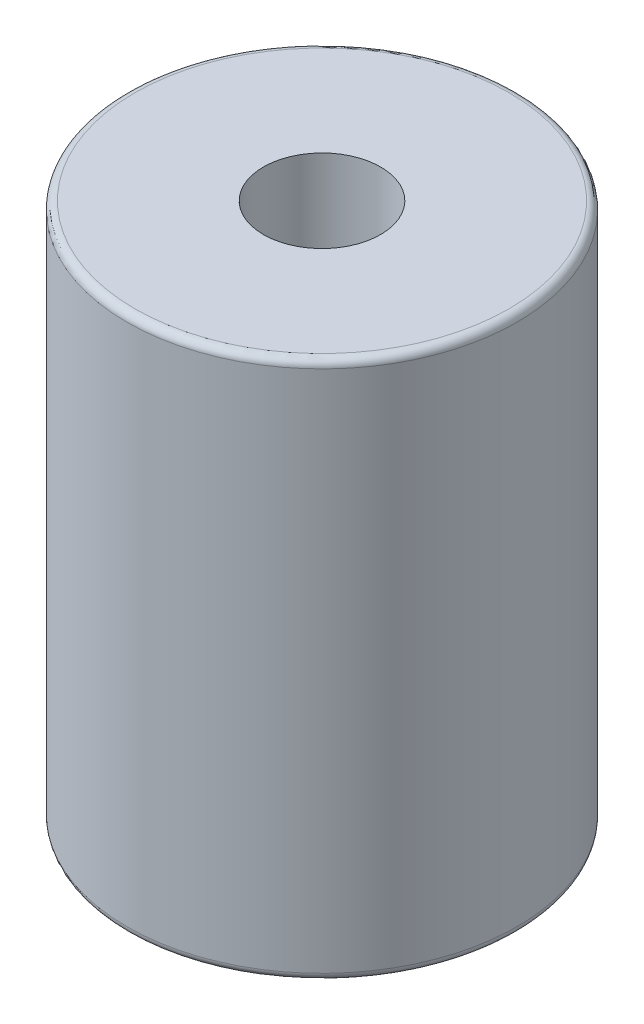
ISO-10303-21;
HEADER;
FILE_DESCRIPTION(('STEP AP214'),'2;1');
FILE_NAME('part.step','',(''),(''),'','','');
FILE_SCHEMA(('AUTOMOTIVE_DESIGN { 1 0 10303 214 1 1 1 1 }'));
ENDSEC;
DATA;
#1=APPLICATION_CONTEXT('core data for automotive mechanical design processes');
#2=APPLICATION_PROTOCOL_DEFINITION('international standard','automotive_design',2000,#1);
#3=PRODUCT_CONTEXT('',#1,'mechanical');
#4=PRODUCT('Part','Part','',(#3));
#5=PRODUCT_RELATED_PRODUCT_CATEGORY('part','',(#4));
#6=PRODUCT_DEFINITION_FORMATION('','',#4);
#7=PRODUCT_DEFINITION_CONTEXT('part definition',#1,'design');
#8=PRODUCT_DEFINITION('design','',#6,#7);
#9=PRODUCT_DEFINITION_SHAPE('','',#8);
#10=(LENGTH_UNIT() NAMED_UNIT(*) SI_UNIT(.MILLI.,.METRE.));
#11=(NAMED_UNIT(*) PLANE_ANGLE_UNIT() SI_UNIT($,.RADIAN.));
#12=(NAMED_UNIT(*) SI_UNIT($,.STERADIAN.) SOLID_ANGLE_UNIT());
#13=UNCERTAINTY_MEASURE_WITH_UNIT(LENGTH_MEASURE(1.E-05),#10,'distance_accuracy_value','');
#14=(GEOMETRIC_REPRESENTATION_CONTEXT(3) GLOBAL_UNCERTAINTY_ASSIGNED_CONTEXT((#13)) GLOBAL_UNIT_ASSIGNED_CONTEXT((#10,
#11,#12)) REPRESENTATION_CONTEXT('',''));
#15=CARTESIAN_POINT('',(0.,0.,0.));
#16=DIRECTION('',(0.,0.,1.));
#17=DIRECTION('',(1.,0.,0.));
#18=AXIS2_PLACEMENT_3D('',#15,#16,#17);
#19=CARTESIAN_POINT('',(0.,6.9,0.));
#20=DIRECTION('',(0.,-1.,0.));
#21=DIRECTION('',(0.,0.,-1.));
#22=AXIS2_PLACEMENT_3D('',#19,#20,#21);
#23=CYLINDRICAL_SURFACE('',#22,2.495);
#24=CARTESIAN_POINT('',(0.,0.0999999999999994,0.));
#25=DIRECTION('',(0.,1.,0.));
#26=DIRECTION('',(0.,0.,1.));
#27=AXIS2_PLACEMENT_3D('',#24,#25,#26);
#28=CIRCLE('',#27,2.495);
#29=CARTESIAN_POINT('',(0.,0.0999999999999994,2.495));
#30=VERTEX_POINT('',#29);
#31=EDGE_CURVE('E59',#30,#30,#28,.T.);
#32=ORIENTED_EDGE('',*,*,#31,.T.);
#33=EDGE_LOOP('',(#32));
#34=FACE_BOUND('',#33,.T.);
#35=CARTESIAN_POINT('',(0.,6.8,0.));
#36=DIRECTION('',(0.,1.,0.));
#37=DIRECTION('',(0.,0.,1.));
#38=AXIS2_PLACEMENT_3D('',#35,#36,#37);
#39=CIRCLE('',#38,2.495);
#40=CARTESIAN_POINT('',(0.,6.8,2.495));
#41=VERTEX_POINT('',#40);
#42=EDGE_CURVE('E63',#41,#41,#39,.F.);
#43=ORIENTED_EDGE('',*,*,#42,.T.);
#44=EDGE_LOOP('',(#43));
#45=FACE_BOUND('',#44,.T.);
#46=ADVANCED_FACE('F48',(#34,#45),#23,.T.);
#47=CARTESIAN_POINT('',(0.,6.9,0.));
#48=DIRECTION('',(0.,1.,0.));
#49=DIRECTION('',(0.,0.,1.));
#50=AXIS2_PLACEMENT_3D('',#47,#48,#49);
#51=PLANE('',#50);
#52=CARTESIAN_POINT('',(0.,6.9,0.));
#53=DIRECTION('',(0.,1.,0.));
#54=DIRECTION('',(0.,0.,1.));
#55=AXIS2_PLACEMENT_3D('',#52,#53,#54);
#56=CIRCLE('',#55,0.75);
#57=CARTESIAN_POINT('',(0.,6.9,0.75));
#58=VERTEX_POINT('',#57);
#59=EDGE_CURVE('E69',#58,#58,#56,.T.);
#60=ORIENTED_EDGE('',*,*,#59,.F.);
#61=EDGE_LOOP('',(#60));
#62=FACE_BOUND('',#61,.T.);
#63=CARTESIAN_POINT('',(0.,6.9,0.));
#64=DIRECTION('',(0.,1.,0.));
#65=DIRECTION('',(0.,0.,1.));
#66=AXIS2_PLACEMENT_3D('',#63,#64,#65);
#67=CIRCLE('',#66,2.395);
#68=CARTESIAN_POINT('',(0.,6.9,2.395));
#69=VERTEX_POINT('',#68);
#70=EDGE_CURVE('E12',#69,#69,#67,.T.);
#71=ORIENTED_EDGE('',*,*,#70,.T.);
#72=EDGE_LOOP('',(#71));
#73=FACE_BOUND('',#72,.T.);
#74=ADVANCED_FACE('F83',(#62,#73),#51,.T.);
#75=CARTESIAN_POINT('',(0.,0.,0.));
#76=DIRECTION('',(0.,1.,0.));
#77=DIRECTION('',(0.,0.,1.));
#78=AXIS2_PLACEMENT_3D('',#75,#76,#77);
#79=PLANE('',#78);
#80=CARTESIAN_POINT('',(0.,0.,0.));
#81=DIRECTION('',(0.,1.,0.));
#82=DIRECTION('',(0.,0.,1.));
#83=AXIS2_PLACEMENT_3D('',#80,#81,#82);
#84=CIRCLE('',#83,2.395);
#85=CARTESIAN_POINT('',(0.,0.,2.395));
#86=VERTEX_POINT('',#85);
#87=EDGE_CURVE('E55',#86,#86,#84,.F.);
#88=ORIENTED_EDGE('',*,*,#87,.T.);
#89=EDGE_LOOP('',(#88));
#90=FACE_BOUND('',#89,.T.);
#91=ADVANCED_FACE('F85',(#90),#79,.F.);
#92=CARTESIAN_POINT('',(0.,0.0999999999999994,0.));
#93=DIRECTION('',(0.,1.,0.));
#94=DIRECTION('',(0.,0.,1.));
#95=AXIS2_PLACEMENT_3D('',#92,#93,#94);
#96=TOROIDAL_SURFACE('',#95,2.395,0.1);
#97=ORIENTED_EDGE('',*,*,#87,.F.);
#98=EDGE_LOOP('',(#97));
#99=FACE_BOUND('',#98,.T.);
#100=ORIENTED_EDGE('',*,*,#31,.F.);
#101=EDGE_LOOP('',(#100));
#102=FACE_BOUND('',#101,.T.);
#103=ADVANCED_FACE('F91',(#99,#102),#96,.T.);
#104=CARTESIAN_POINT('',(0.,6.8,0.));
#105=DIRECTION('',(0.,1.,0.));
#106=DIRECTION('',(0.,0.,1.));
#107=AXIS2_PLACEMENT_3D('',#104,#105,#106);
#108=TOROIDAL_SURFACE('',#107,2.395,0.1);
#109=ORIENTED_EDGE('',*,*,#42,.F.);
#110=EDGE_LOOP('',(#109));
#111=FACE_BOUND('',#110,.T.);
#112=ORIENTED_EDGE('',*,*,#70,.F.);
#113=EDGE_LOOP('',(#112));
#114=FACE_BOUND('',#113,.T.);
#115=ADVANCED_FACE('F50',(#111,#114),#108,.T.);
#116=CARTESIAN_POINT('',(0.,3.9,0.));
#117=DIRECTION('',(0.,1.,0.));
#118=DIRECTION('',(0.,0.,1.));
#119=AXIS2_PLACEMENT_3D('',#116,#117,#118);
#120=CYLINDRICAL_SURFACE('',#119,0.75);
#121=CARTESIAN_POINT('',(0.,3.9,0.));
#122=DIRECTION('',(0.,1.,0.));
#123=DIRECTION('',(0.,0.,1.));
#124=AXIS2_PLACEMENT_3D('',#121,#122,#123);
#125=CIRCLE('',#124,0.75);
#126=CARTESIAN_POINT('',(0.,3.9,0.75));
#127=VERTEX_POINT('',#126);
#128=EDGE_CURVE('E68',#127,#127,#125,.T.);
#129=ORIENTED_EDGE('',*,*,#128,.F.);
#130=EDGE_LOOP('',(#129));
#131=FACE_BOUND('',#130,.T.);
#132=ORIENTED_EDGE('',*,*,#59,.T.);
#133=EDGE_LOOP('',(#132));
#134=FACE_BOUND('',#133,.T.);
#135=ADVANCED_FACE('F77',(#131,#134),#120,.F.);
#136=CARTESIAN_POINT('',(0.,3.9,0.));
#137=DIRECTION('',(0.,1.,0.));
#138=DIRECTION('',(0.,0.,1.));
#139=AXIS2_PLACEMENT_3D('',#136,#137,#138);
#140=PLANE('',#139);
#141=ORIENTED_EDGE('',*,*,#128,.T.);
#142=EDGE_LOOP('',(#141));
#143=FACE_BOUND('',#142,.T.);
#144=ADVANCED_FACE('F75',(#143),#140,.T.);
#145=CLOSED_SHELL('',(#46,#74,#91,#103,#115,#135,#144));
#146=MANIFOLD_SOLID_BREP('B2',#145);
#147=ADVANCED_BREP_SHAPE_REPRESENTATION('',(#18,#146),#14);
#148=SHAPE_DEFINITION_REPRESENTATION(#9,#147);
ENDSEC;
END-ISO-10303-21;
